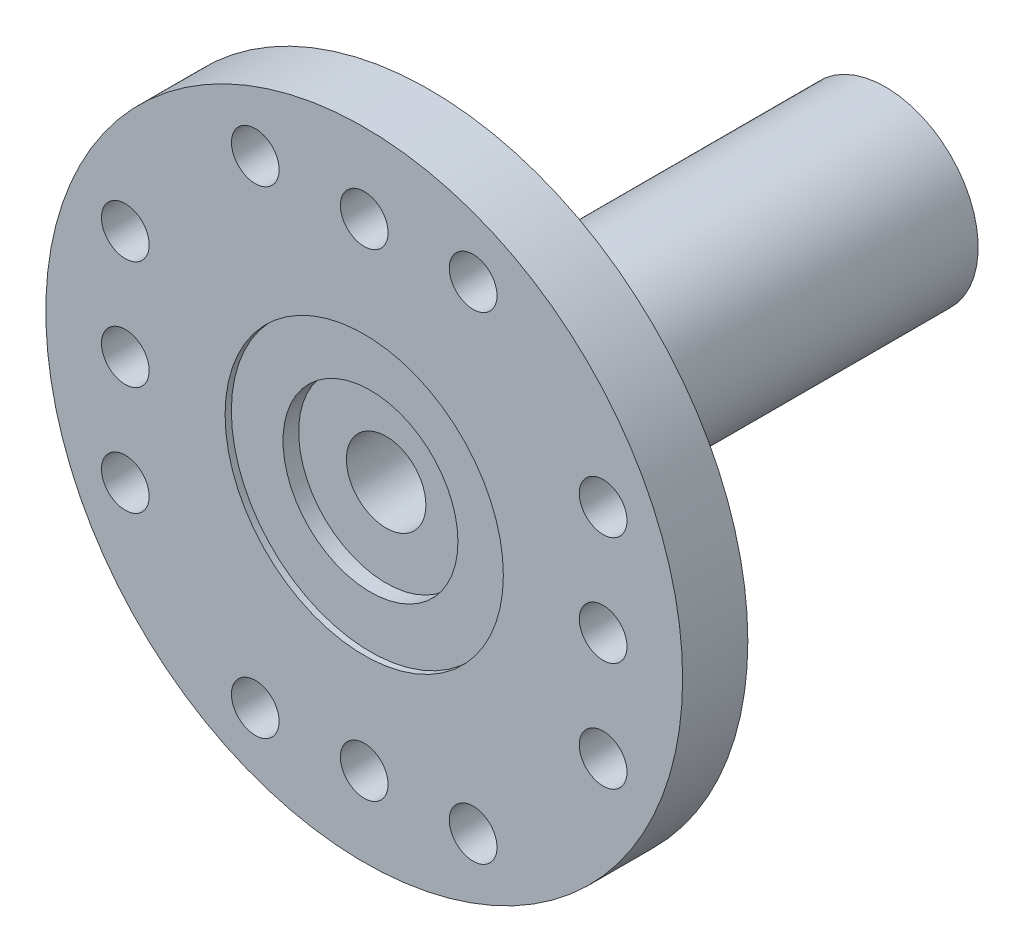
ISO-10303-21;
HEADER;
FILE_DESCRIPTION(('STEP AP214'),'2;1');
FILE_NAME('part.step','',(''),(''),'','','');
FILE_SCHEMA(('AUTOMOTIVE_DESIGN { 1 0 10303 214 1 1 1 1 }'));
ENDSEC;
DATA;
#1=APPLICATION_CONTEXT('core data for automotive mechanical design processes');
#2=APPLICATION_PROTOCOL_DEFINITION('international standard','automotive_design',2000,#1);
#3=PRODUCT_CONTEXT('',#1,'mechanical');
#4=PRODUCT('Part','Part','',(#3));
#5=PRODUCT_RELATED_PRODUCT_CATEGORY('part','',(#4));
#6=PRODUCT_DEFINITION_FORMATION('','',#4);
#7=PRODUCT_DEFINITION_CONTEXT('part definition',#1,'design');
#8=PRODUCT_DEFINITION('design','',#6,#7);
#9=PRODUCT_DEFINITION_SHAPE('','',#8);
#10=(LENGTH_UNIT() NAMED_UNIT(*) SI_UNIT(.MILLI.,.METRE.));
#11=(NAMED_UNIT(*) PLANE_ANGLE_UNIT() SI_UNIT($,.RADIAN.));
#12=(NAMED_UNIT(*) SI_UNIT($,.STERADIAN.) SOLID_ANGLE_UNIT());
#13=UNCERTAINTY_MEASURE_WITH_UNIT(LENGTH_MEASURE(1.E-05),#10,'distance_accuracy_value','');
#14=(GEOMETRIC_REPRESENTATION_CONTEXT(3) GLOBAL_UNCERTAINTY_ASSIGNED_CONTEXT((#13)) GLOBAL_UNIT_ASSIGNED_CONTEXT((#10,
#11,#12)) REPRESENTATION_CONTEXT('',''));
#15=CARTESIAN_POINT('',(0.,0.,0.));
#16=DIRECTION('',(0.,0.,1.));
#17=DIRECTION('',(1.,0.,0.));
#18=AXIS2_PLACEMENT_3D('',#15,#16,#17);
#19=CARTESIAN_POINT('',(0.,0.,-3.302));
#20=DIRECTION('',(0.,0.,-1.));
#21=DIRECTION('',(-1.,0.,0.));
#22=AXIS2_PLACEMENT_3D('',#19,#20,#21);
#23=PLANE('',#22);
#24=CARTESIAN_POINT('',(0.,0.,-3.302));
#25=DIRECTION('',(0.,0.,-1.));
#26=DIRECTION('',(-1.,0.,0.));
#27=AXIS2_PLACEMENT_3D('',#24,#25,#26);
#28=CIRCLE('',#27,4.699);
#29=CARTESIAN_POINT('',(-4.699,0.,-3.302));
#30=VERTEX_POINT('',#29);
#31=EDGE_CURVE('E46',#30,#30,#28,.T.);
#32=ORIENTED_EDGE('',*,*,#31,.T.);
#33=EDGE_LOOP('',(#32));
#34=FACE_BOUND('',#33,.T.);
#35=CARTESIAN_POINT('',(0.,0.,-3.302));
#36=DIRECTION('',(0.,0.,-1.));
#37=DIRECTION('',(-1.,0.,0.));
#38=AXIS2_PLACEMENT_3D('',#35,#36,#37);
#39=CIRCLE('',#38,2.9591);
#40=CARTESIAN_POINT('',(-2.9591,0.,-3.302));
#41=VERTEX_POINT('',#40);
#42=EDGE_CURVE('E51',#41,#41,#39,.T.);
#43=ORIENTED_EDGE('',*,*,#42,.F.);
#44=EDGE_LOOP('',(#43));
#45=FACE_BOUND('',#44,.T.);
#46=ADVANCED_FACE('F30',(#34,#45),#23,.T.);
#47=CARTESIAN_POINT('',(0.,0.,0.));
#48=DIRECTION('',(0.,0.,1.));
#49=DIRECTION('',(1.,0.,0.));
#50=AXIS2_PLACEMENT_3D('',#47,#48,#49);
#51=PLANE('',#50);
#52=CARTESIAN_POINT('',(3.47980000000008,-7.63269999999996,0.));
#53=DIRECTION('',(0.,0.,1.));
#54=DIRECTION('',(1.,0.,0.));
#55=AXIS2_PLACEMENT_3D('',#52,#53,#54);
#56=CIRCLE('',#55,0.762000000000002);
#57=CARTESIAN_POINT('',(4.24180000000008,-7.63269999999996,0.));
#58=VERTEX_POINT('',#57);
#59=EDGE_CURVE('E140',#58,#58,#56,.F.);
#60=ORIENTED_EDGE('',*,*,#59,.F.);
#61=EDGE_LOOP('',(#60));
#62=FACE_BOUND('',#61,.T.);
#63=CARTESIAN_POINT('',(-3.47979999999992,-7.63270000000004,0.));
#64=DIRECTION('',(0.,0.,1.));
#65=DIRECTION('',(1.,0.,0.));
#66=AXIS2_PLACEMENT_3D('',#63,#64,#65);
#67=CIRCLE('',#66,0.762000000000001);
#68=CARTESIAN_POINT('',(-2.71779999999992,-7.63270000000004,0.));
#69=VERTEX_POINT('',#68);
#70=EDGE_CURVE('E134',#69,#69,#67,.F.);
#71=ORIENTED_EDGE('',*,*,#70,.F.);
#72=EDGE_LOOP('',(#71));
#73=FACE_BOUND('',#72,.T.);
#74=CARTESIAN_POINT('',(0.,-7.6327,0.));
#75=DIRECTION('',(0.,0.,1.));
#76=DIRECTION('',(1.,0.,0.));
#77=AXIS2_PLACEMENT_3D('',#74,#75,#76);
#78=CIRCLE('',#77,0.762000000000001);
#79=CARTESIAN_POINT('',(0.762000000000081,-7.6327,0.));
#80=VERTEX_POINT('',#79);
#81=EDGE_CURVE('E128',#80,#80,#78,.F.);
#82=ORIENTED_EDGE('',*,*,#81,.F.);
#83=EDGE_LOOP('',(#82));
#84=FACE_BOUND('',#83,.T.);
#85=CARTESIAN_POINT('',(-7.63269999999998,-3.47980000000005,0.));
#86=DIRECTION('',(0.,0.,1.));
#87=DIRECTION('',(1.,0.,0.));
#88=AXIS2_PLACEMENT_3D('',#85,#86,#87);
#89=CIRCLE('',#88,0.762000000000002);
#90=CARTESIAN_POINT('',(-6.87069999999997,-3.47980000000005,0.));
#91=VERTEX_POINT('',#90);
#92=EDGE_CURVE('E122',#91,#91,#89,.F.);
#93=ORIENTED_EDGE('',*,*,#92,.F.);
#94=EDGE_LOOP('',(#93));
#95=FACE_BOUND('',#94,.T.);
#96=CARTESIAN_POINT('',(-7.63270000000002,3.47979999999995,0.));
#97=DIRECTION('',(0.,0.,1.));
#98=DIRECTION('',(1.,0.,0.));
#99=AXIS2_PLACEMENT_3D('',#96,#97,#98);
#100=CIRCLE('',#99,0.762000000000001);
#101=CARTESIAN_POINT('',(-6.87070000000002,3.47979999999995,0.));
#102=VERTEX_POINT('',#101);
#103=EDGE_CURVE('E116',#102,#102,#100,.F.);
#104=ORIENTED_EDGE('',*,*,#103,.F.);
#105=EDGE_LOOP('',(#104));
#106=FACE_BOUND('',#105,.T.);
#107=CARTESIAN_POINT('',(-7.6327,0.,0.));
#108=DIRECTION('',(0.,0.,1.));
#109=DIRECTION('',(1.,0.,0.));
#110=AXIS2_PLACEMENT_3D('',#107,#108,#109);
#111=CIRCLE('',#110,0.762000000000001);
#112=CARTESIAN_POINT('',(-6.8707,0.,0.));
#113=VERTEX_POINT('',#112);
#114=EDGE_CURVE('E110',#113,#113,#111,.F.);
#115=ORIENTED_EDGE('',*,*,#114,.F.);
#116=EDGE_LOOP('',(#115));
#117=FACE_BOUND('',#116,.T.);
#118=CARTESIAN_POINT('',(-3.47980000000003,7.63269999999999,0.));
#119=DIRECTION('',(0.,0.,1.));
#120=DIRECTION('',(1.,0.,0.));
#121=AXIS2_PLACEMENT_3D('',#118,#119,#120);
#122=CIRCLE('',#121,0.762000000000002);
#123=CARTESIAN_POINT('',(-2.71780000000002,7.63269999999999,0.));
#124=VERTEX_POINT('',#123);
#125=EDGE_CURVE('E104',#124,#124,#122,.F.);
#126=ORIENTED_EDGE('',*,*,#125,.F.);
#127=EDGE_LOOP('',(#126));
#128=FACE_BOUND('',#127,.T.);
#129=CARTESIAN_POINT('',(3.47979999999997,7.63270000000001,0.));
#130=DIRECTION('',(0.,0.,1.));
#131=DIRECTION('',(1.,0.,0.));
#132=AXIS2_PLACEMENT_3D('',#129,#130,#131);
#133=CIRCLE('',#132,0.762000000000001);
#134=CARTESIAN_POINT('',(4.24179999999997,7.63270000000001,0.));
#135=VERTEX_POINT('',#134);
#136=EDGE_CURVE('E98',#135,#135,#133,.F.);
#137=ORIENTED_EDGE('',*,*,#136,.F.);
#138=EDGE_LOOP('',(#137));
#139=FACE_BOUND('',#138,.T.);
#140=CARTESIAN_POINT('',(0.,7.6327,0.));
#141=DIRECTION('',(0.,0.,1.));
#142=DIRECTION('',(1.,0.,0.));
#143=AXIS2_PLACEMENT_3D('',#140,#141,#142);
#144=CIRCLE('',#143,0.762000000000001);
#145=CARTESIAN_POINT('',(0.761999999999974,7.6327,0.));
#146=VERTEX_POINT('',#145);
#147=EDGE_CURVE('E92',#146,#146,#144,.F.);
#148=ORIENTED_EDGE('',*,*,#147,.F.);
#149=EDGE_LOOP('',(#148));
#150=FACE_BOUND('',#149,.T.);
#151=CARTESIAN_POINT('',(7.6327,3.4798,0.));
#152=DIRECTION('',(0.,0.,1.));
#153=DIRECTION('',(1.,0.,0.));
#154=AXIS2_PLACEMENT_3D('',#151,#152,#153);
#155=CIRCLE('',#154,0.762000000000002);
#156=CARTESIAN_POINT('',(8.3947,3.4798,0.));
#157=VERTEX_POINT('',#156);
#158=EDGE_CURVE('E86',#157,#157,#155,.F.);
#159=ORIENTED_EDGE('',*,*,#158,.F.);
#160=EDGE_LOOP('',(#159));
#161=FACE_BOUND('',#160,.T.);
#162=CARTESIAN_POINT('',(7.6327,-3.4798,0.));
#163=DIRECTION('',(0.,0.,1.));
#164=DIRECTION('',(1.,0.,0.));
#165=AXIS2_PLACEMENT_3D('',#162,#163,#164);
#166=CIRCLE('',#165,0.762000000000001);
#167=CARTESIAN_POINT('',(8.3947,-3.4798,0.));
#168=VERTEX_POINT('',#167);
#169=EDGE_CURVE('E80',#168,#168,#166,.F.);
#170=ORIENTED_EDGE('',*,*,#169,.F.);
#171=EDGE_LOOP('',(#170));
#172=FACE_BOUND('',#171,.T.);
#173=CARTESIAN_POINT('',(7.6327,0.,0.));
#174=DIRECTION('',(0.,0.,1.));
#175=DIRECTION('',(1.,0.,0.));
#176=AXIS2_PLACEMENT_3D('',#173,#174,#175);
#177=CIRCLE('',#176,0.762000000000001);
#178=CARTESIAN_POINT('',(8.3947,0.,0.));
#179=VERTEX_POINT('',#178);
#180=EDGE_CURVE('E72',#179,#179,#177,.F.);
#181=ORIENTED_EDGE('',*,*,#180,.F.);
#182=EDGE_LOOP('',(#181));
#183=FACE_BOUND('',#182,.T.);
#184=CARTESIAN_POINT('',(0.,0.,0.));
#185=DIRECTION('',(0.,0.,1.));
#186=DIRECTION('',(1.,0.,0.));
#187=AXIS2_PLACEMENT_3D('',#184,#185,#186);
#188=CIRCLE('',#187,10.1727);
#189=CARTESIAN_POINT('',(10.1727,0.,0.));
#190=VERTEX_POINT('',#189);
#191=EDGE_CURVE('E41',#190,#190,#188,.T.);
#192=ORIENTED_EDGE('',*,*,#191,.F.);
#193=EDGE_LOOP('',(#192));
#194=FACE_BOUND('',#193,.T.);
#195=CARTESIAN_POINT('',(0.,0.,0.));
#196=DIRECTION('',(0.,0.,1.));
#197=DIRECTION('',(1.,0.,0.));
#198=AXIS2_PLACEMENT_3D('',#195,#196,#197);
#199=CIRCLE('',#198,4.699);
#200=CARTESIAN_POINT('',(4.699,0.,0.));
#201=VERTEX_POINT('',#200);
#202=EDGE_CURVE('E10',#201,#201,#199,.F.);
#203=ORIENTED_EDGE('',*,*,#202,.F.);
#204=EDGE_LOOP('',(#203));
#205=FACE_BOUND('',#204,.T.);
#206=ADVANCED_FACE('F197',(#62,#73,#84,#95,#106,#117,#128,#139,#150,#161,#172,#183,#194,#205),
#51,.F.);
#207=CARTESIAN_POINT('',(0.,0.,2.0828));
#208=DIRECTION('',(0.,0.,-1.));
#209=DIRECTION('',(-1.,0.,0.));
#210=AXIS2_PLACEMENT_3D('',#207,#208,#209);
#211=CYLINDRICAL_SURFACE('',#210,10.1727);
#212=CARTESIAN_POINT('',(0.,0.,2.0828));
#213=DIRECTION('',(0.,0.,1.));
#214=DIRECTION('',(1.,0.,0.));
#215=AXIS2_PLACEMENT_3D('',#212,#213,#214);
#216=CIRCLE('',#215,10.1727);
#217=CARTESIAN_POINT('',(10.1727,0.,2.0828));
#218=VERTEX_POINT('',#217);
#219=EDGE_CURVE('E37',#218,#218,#216,.T.);
#220=ORIENTED_EDGE('',*,*,#219,.F.);
#221=EDGE_LOOP('',(#220));
#222=FACE_BOUND('',#221,.T.);
#223=ORIENTED_EDGE('',*,*,#191,.T.);
#224=EDGE_LOOP('',(#223));
#225=FACE_BOUND('',#224,.T.);
#226=ADVANCED_FACE('F32',(#222,#225),#211,.T.);
#227=CARTESIAN_POINT('',(0.,0.,2.0828));
#228=DIRECTION('',(0.,0.,1.));
#229=DIRECTION('',(1.,0.,0.));
#230=AXIS2_PLACEMENT_3D('',#227,#228,#229);
#231=PLANE('',#230);
#232=CARTESIAN_POINT('',(3.47980000000008,-7.63269999999996,2.0828));
#233=DIRECTION('',(0.,0.,1.));
#234=DIRECTION('',(0.,-1.,0.));
#235=AXIS2_PLACEMENT_3D('',#232,#233,#234);
#236=CIRCLE('',#235,0.762000000000002);
#237=CARTESIAN_POINT('',(3.47980000000009,-8.39469999999996,2.0828));
#238=VERTEX_POINT('',#237);
#239=EDGE_CURVE('E143',#238,#238,#236,.T.);
#240=ORIENTED_EDGE('',*,*,#239,.F.);
#241=EDGE_LOOP('',(#240));
#242=FACE_BOUND('',#241,.T.);
#243=CARTESIAN_POINT('',(-3.47979999999992,-7.63270000000004,2.0828));
#244=DIRECTION('',(0.,0.,1.));
#245=DIRECTION('',(0.,-1.,0.));
#246=AXIS2_PLACEMENT_3D('',#243,#244,#245);
#247=CIRCLE('',#246,0.762000000000001);
#248=CARTESIAN_POINT('',(-3.47979999999991,-8.39470000000004,2.0828));
#249=VERTEX_POINT('',#248);
#250=EDGE_CURVE('E137',#249,#249,#247,.T.);
#251=ORIENTED_EDGE('',*,*,#250,.F.);
#252=EDGE_LOOP('',(#251));
#253=FACE_BOUND('',#252,.T.);
#254=CARTESIAN_POINT('',(0.,-7.6327,2.0828));
#255=DIRECTION('',(0.,0.,1.));
#256=DIRECTION('',(0.,-1.,0.));
#257=AXIS2_PLACEMENT_3D('',#254,#255,#256);
#258=CIRCLE('',#257,0.762000000000001);
#259=CARTESIAN_POINT('',(0.,-8.3947,2.0828));
#260=VERTEX_POINT('',#259);
#261=EDGE_CURVE('E131',#260,#260,#258,.T.);
#262=ORIENTED_EDGE('',*,*,#261,.F.);
#263=EDGE_LOOP('',(#262));
#264=FACE_BOUND('',#263,.T.);
#265=CARTESIAN_POINT('',(-7.63269999999998,-3.47980000000005,2.0828));
#266=DIRECTION('',(0.,0.,1.));
#267=DIRECTION('',(-1.,0.,0.));
#268=AXIS2_PLACEMENT_3D('',#265,#266,#267);
#269=CIRCLE('',#268,0.762000000000002);
#270=CARTESIAN_POINT('',(-8.39469999999998,-3.47980000000006,2.0828));
#271=VERTEX_POINT('',#270);
#272=EDGE_CURVE('E125',#271,#271,#269,.T.);
#273=ORIENTED_EDGE('',*,*,#272,.F.);
#274=EDGE_LOOP('',(#273));
#275=FACE_BOUND('',#274,.T.);
#276=CARTESIAN_POINT('',(-7.63270000000002,3.47979999999995,2.0828));
#277=DIRECTION('',(0.,0.,1.));
#278=DIRECTION('',(-1.,0.,0.));
#279=AXIS2_PLACEMENT_3D('',#276,#277,#278);
#280=CIRCLE('',#279,0.762000000000001);
#281=CARTESIAN_POINT('',(-8.39470000000002,3.47979999999994,2.0828));
#282=VERTEX_POINT('',#281);
#283=EDGE_CURVE('E119',#282,#282,#280,.T.);
#284=ORIENTED_EDGE('',*,*,#283,.F.);
#285=EDGE_LOOP('',(#284));
#286=FACE_BOUND('',#285,.T.);
#287=CARTESIAN_POINT('',(-7.6327,0.,2.0828));
#288=DIRECTION('',(0.,0.,1.));
#289=DIRECTION('',(-1.,0.,0.));
#290=AXIS2_PLACEMENT_3D('',#287,#288,#289);
#291=CIRCLE('',#290,0.762000000000001);
#292=CARTESIAN_POINT('',(-8.3947,0.,2.0828));
#293=VERTEX_POINT('',#292);
#294=EDGE_CURVE('E113',#293,#293,#291,.T.);
#295=ORIENTED_EDGE('',*,*,#294,.F.);
#296=EDGE_LOOP('',(#295));
#297=FACE_BOUND('',#296,.T.);
#298=CARTESIAN_POINT('',(-3.47980000000003,7.63269999999999,2.0828));
#299=DIRECTION('',(0.,0.,1.));
#300=DIRECTION('',(0.,1.,0.));
#301=AXIS2_PLACEMENT_3D('',#298,#299,#300);
#302=CIRCLE('',#301,0.762000000000002);
#303=CARTESIAN_POINT('',(-3.47980000000003,8.39469999999999,2.0828));
#304=VERTEX_POINT('',#303);
#305=EDGE_CURVE('E107',#304,#304,#302,.T.);
#306=ORIENTED_EDGE('',*,*,#305,.F.);
#307=EDGE_LOOP('',(#306));
#308=FACE_BOUND('',#307,.T.);
#309=CARTESIAN_POINT('',(3.47979999999997,7.63270000000001,2.0828));
#310=DIRECTION('',(0.,0.,1.));
#311=DIRECTION('',(0.,1.,0.));
#312=AXIS2_PLACEMENT_3D('',#309,#310,#311);
#313=CIRCLE('',#312,0.762000000000001);
#314=CARTESIAN_POINT('',(3.47979999999997,8.39470000000001,2.0828));
#315=VERTEX_POINT('',#314);
#316=EDGE_CURVE('E101',#315,#315,#313,.T.);
#317=ORIENTED_EDGE('',*,*,#316,.F.);
#318=EDGE_LOOP('',(#317));
#319=FACE_BOUND('',#318,.T.);
#320=CARTESIAN_POINT('',(0.,7.6327,2.0828));
#321=DIRECTION('',(0.,0.,1.));
#322=DIRECTION('',(0.,1.,0.));
#323=AXIS2_PLACEMENT_3D('',#320,#321,#322);
#324=CIRCLE('',#323,0.762000000000001);
#325=CARTESIAN_POINT('',(0.,8.3947,2.0828));
#326=VERTEX_POINT('',#325);
#327=EDGE_CURVE('E95',#326,#326,#324,.T.);
#328=ORIENTED_EDGE('',*,*,#327,.F.);
#329=EDGE_LOOP('',(#328));
#330=FACE_BOUND('',#329,.T.);
#331=CARTESIAN_POINT('',(7.6327,3.4798,2.0828));
#332=DIRECTION('',(0.,0.,1.));
#333=DIRECTION('',(1.,0.,0.));
#334=AXIS2_PLACEMENT_3D('',#331,#332,#333);
#335=CIRCLE('',#334,0.762000000000002);
#336=CARTESIAN_POINT('',(8.3947,3.4798,2.0828));
#337=VERTEX_POINT('',#336);
#338=EDGE_CURVE('E89',#337,#337,#335,.T.);
#339=ORIENTED_EDGE('',*,*,#338,.F.);
#340=EDGE_LOOP('',(#339));
#341=FACE_BOUND('',#340,.T.);
#342=CARTESIAN_POINT('',(7.6327,-3.4798,2.0828));
#343=DIRECTION('',(0.,0.,1.));
#344=DIRECTION('',(1.,0.,0.));
#345=AXIS2_PLACEMENT_3D('',#342,#343,#344);
#346=CIRCLE('',#345,0.762000000000001);
#347=CARTESIAN_POINT('',(8.3947,-3.4798,2.0828));
#348=VERTEX_POINT('',#347);
#349=EDGE_CURVE('E83',#348,#348,#346,.T.);
#350=ORIENTED_EDGE('',*,*,#349,.F.);
#351=EDGE_LOOP('',(#350));
#352=FACE_BOUND('',#351,.T.);
#353=CARTESIAN_POINT('',(7.6327,0.,2.0828));
#354=DIRECTION('',(0.,0.,1.));
#355=DIRECTION('',(1.,0.,0.));
#356=AXIS2_PLACEMENT_3D('',#353,#354,#355);
#357=CIRCLE('',#356,0.762000000000001);
#358=CARTESIAN_POINT('',(8.3947,0.,2.0828));
#359=VERTEX_POINT('',#358);
#360=EDGE_CURVE('E77',#359,#359,#357,.T.);
#361=ORIENTED_EDGE('',*,*,#360,.F.);
#362=EDGE_LOOP('',(#361));
#363=FACE_BOUND('',#362,.T.);
#364=CARTESIAN_POINT('',(0.,0.,2.0828));
#365=DIRECTION('',(0.,0.,1.));
#366=DIRECTION('',(1.,0.,0.));
#367=AXIS2_PLACEMENT_3D('',#364,#365,#366);
#368=CIRCLE('',#367,4.445);
#369=CARTESIAN_POINT('',(4.445,0.,2.0828));
#370=VERTEX_POINT('',#369);
#371=EDGE_CURVE('E57',#370,#370,#368,.T.);
#372=ORIENTED_EDGE('',*,*,#371,.F.);
#373=EDGE_LOOP('',(#372));
#374=FACE_BOUND('',#373,.T.);
#375=ORIENTED_EDGE('',*,*,#219,.T.);
#376=EDGE_LOOP('',(#375));
#377=FACE_BOUND('',#376,.T.);
#378=ADVANCED_FACE('F150',(#242,#253,#264,#275,#286,#297,#308,#319,#330,#341,#352,#363,#374,
#377),#231,.T.);
#379=CARTESIAN_POINT('',(0.,0.,-3.302));
#380=DIRECTION('',(0.,0.,1.));
#381=DIRECTION('',(1.,0.,0.));
#382=AXIS2_PLACEMENT_3D('',#379,#380,#381);
#383=CYLINDRICAL_SURFACE('',#382,4.699);
#384=ORIENTED_EDGE('',*,*,#31,.F.);
#385=EDGE_LOOP('',(#384));
#386=FACE_BOUND('',#385,.T.);
#387=ORIENTED_EDGE('',*,*,#202,.T.);
#388=EDGE_LOOP('',(#387));
#389=FACE_BOUND('',#388,.T.);
#390=ADVANCED_FACE('F153',(#386,#389),#383,.T.);
#391=CARTESIAN_POINT('',(0.,0.,-14.572));
#392=DIRECTION('',(0.,0.,1.));
#393=DIRECTION('',(1.,0.,0.));
#394=AXIS2_PLACEMENT_3D('',#391,#392,#393);
#395=CYLINDRICAL_SURFACE('',#394,2.9591);
#396=CARTESIAN_POINT('',(0.,0.,-14.572));
#397=DIRECTION('',(0.,0.,-1.));
#398=DIRECTION('',(-1.,0.,0.));
#399=AXIS2_PLACEMENT_3D('',#396,#397,#398);
#400=CIRCLE('',#399,2.9591);
#401=CARTESIAN_POINT('',(-2.9591,0.,-14.572));
#402=VERTEX_POINT('',#401);
#403=EDGE_CURVE('E50',#402,#402,#400,.T.);
#404=ORIENTED_EDGE('',*,*,#403,.F.);
#405=EDGE_LOOP('',(#404));
#406=FACE_BOUND('',#405,.T.);
#407=ORIENTED_EDGE('',*,*,#42,.T.);
#408=EDGE_LOOP('',(#407));
#409=FACE_BOUND('',#408,.T.);
#410=ADVANCED_FACE('F192',(#406,#409),#395,.T.);
#411=CARTESIAN_POINT('',(0.,0.,-14.572));
#412=DIRECTION('',(0.,0.,-1.));
#413=DIRECTION('',(-1.,0.,0.));
#414=AXIS2_PLACEMENT_3D('',#411,#412,#413);
#415=PLANE('',#414);
#416=CARTESIAN_POINT('',(0.,0.,-14.572));
#417=DIRECTION('',(0.,0.,1.));
#418=DIRECTION('',(1.,0.,0.));
#419=AXIS2_PLACEMENT_3D('',#416,#417,#418);
#420=CIRCLE('',#419,1.27);
#421=CARTESIAN_POINT('',(1.27,0.,-14.572));
#422=VERTEX_POINT('',#421);
#423=EDGE_CURVE('E66',#422,#422,#420,.T.);
#424=ORIENTED_EDGE('',*,*,#423,.T.);
#425=EDGE_LOOP('',(#424));
#426=FACE_BOUND('',#425,.T.);
#427=ORIENTED_EDGE('',*,*,#403,.T.);
#428=EDGE_LOOP('',(#427));
#429=FACE_BOUND('',#428,.T.);
#430=ADVANCED_FACE('F182',(#426,#429),#415,.T.);
#431=CARTESIAN_POINT('',(0.,0.,1.8828));
#432=DIRECTION('',(0.,0.,1.));
#433=DIRECTION('',(1.,0.,0.));
#434=AXIS2_PLACEMENT_3D('',#431,#432,#433);
#435=CYLINDRICAL_SURFACE('',#434,4.445);
#436=CARTESIAN_POINT('',(0.,0.,1.8828));
#437=DIRECTION('',(0.,0.,1.));
#438=DIRECTION('',(1.,0.,0.));
#439=AXIS2_PLACEMENT_3D('',#436,#437,#438);
#440=CIRCLE('',#439,4.445);
#441=CARTESIAN_POINT('',(4.445,0.,1.8828));
#442=VERTEX_POINT('',#441);
#443=EDGE_CURVE('E54',#442,#442,#440,.T.);
#444=ORIENTED_EDGE('',*,*,#443,.F.);
#445=EDGE_LOOP('',(#444));
#446=FACE_BOUND('',#445,.T.);
#447=ORIENTED_EDGE('',*,*,#371,.T.);
#448=EDGE_LOOP('',(#447));
#449=FACE_BOUND('',#448,.T.);
#450=ADVANCED_FACE('F179',(#446,#449),#435,.F.);
#451=CARTESIAN_POINT('',(0.,0.,1.8828));
#452=DIRECTION('',(0.,0.,1.));
#453=DIRECTION('',(1.,0.,0.));
#454=AXIS2_PLACEMENT_3D('',#451,#452,#453);
#455=PLANE('',#454);
#456=CARTESIAN_POINT('',(0.,0.,1.8828));
#457=DIRECTION('',(0.,0.,1.));
#458=DIRECTION('',(1.,0.,0.));
#459=AXIS2_PLACEMENT_3D('',#456,#457,#458);
#460=CIRCLE('',#459,2.794);
#461=CARTESIAN_POINT('',(2.794,0.,1.8828));
#462=VERTEX_POINT('',#461);
#463=EDGE_CURVE('E63',#462,#462,#460,.T.);
#464=ORIENTED_EDGE('',*,*,#463,.F.);
#465=EDGE_LOOP('',(#464));
#466=FACE_BOUND('',#465,.T.);
#467=ORIENTED_EDGE('',*,*,#443,.T.);
#468=EDGE_LOOP('',(#467));
#469=FACE_BOUND('',#468,.T.);
#470=ADVANCED_FACE('F181',(#466,#469),#455,.T.);
#471=CARTESIAN_POINT('',(0.,0.,1.3828));
#472=DIRECTION('',(0.,0.,1.));
#473=DIRECTION('',(1.,0.,0.));
#474=AXIS2_PLACEMENT_3D('',#471,#472,#473);
#475=CYLINDRICAL_SURFACE('',#474,2.794);
#476=CARTESIAN_POINT('',(0.,0.,1.3828));
#477=DIRECTION('',(0.,0.,1.));
#478=DIRECTION('',(1.,0.,0.));
#479=AXIS2_PLACEMENT_3D('',#476,#477,#478);
#480=CIRCLE('',#479,2.794);
#481=CARTESIAN_POINT('',(2.794,0.,1.3828));
#482=VERTEX_POINT('',#481);
#483=EDGE_CURVE('E60',#482,#482,#480,.T.);
#484=ORIENTED_EDGE('',*,*,#483,.F.);
#485=EDGE_LOOP('',(#484));
#486=FACE_BOUND('',#485,.T.);
#487=ORIENTED_EDGE('',*,*,#463,.T.);
#488=EDGE_LOOP('',(#487));
#489=FACE_BOUND('',#488,.T.);
#490=ADVANCED_FACE('F189',(#486,#489),#475,.F.);
#491=CARTESIAN_POINT('',(0.,0.,1.3828));
#492=DIRECTION('',(0.,0.,1.));
#493=DIRECTION('',(1.,0.,0.));
#494=AXIS2_PLACEMENT_3D('',#491,#492,#493);
#495=PLANE('',#494);
#496=CARTESIAN_POINT('',(0.,0.,1.3828));
#497=DIRECTION('',(0.,0.,1.));
#498=DIRECTION('',(1.,0.,0.));
#499=AXIS2_PLACEMENT_3D('',#496,#497,#498);
#500=CIRCLE('',#499,1.27);
#501=CARTESIAN_POINT('',(1.27,0.,1.3828));
#502=VERTEX_POINT('',#501);
#503=EDGE_CURVE('E69',#502,#502,#500,.T.);
#504=ORIENTED_EDGE('',*,*,#503,.F.);
#505=EDGE_LOOP('',(#504));
#506=FACE_BOUND('',#505,.T.);
#507=ORIENTED_EDGE('',*,*,#483,.T.);
#508=EDGE_LOOP('',(#507));
#509=FACE_BOUND('',#508,.T.);
#510=ADVANCED_FACE('F235',(#506,#509),#495,.T.);
#511=CARTESIAN_POINT('',(0.,0.,-14.572));
#512=DIRECTION('',(0.,0.,1.));
#513=DIRECTION('',(1.,0.,0.));
#514=AXIS2_PLACEMENT_3D('',#511,#512,#513);
#515=CYLINDRICAL_SURFACE('',#514,1.27);
#516=ORIENTED_EDGE('',*,*,#423,.F.);
#517=EDGE_LOOP('',(#516));
#518=FACE_BOUND('',#517,.T.);
#519=ORIENTED_EDGE('',*,*,#503,.T.);
#520=EDGE_LOOP('',(#519));
#521=FACE_BOUND('',#520,.T.);
#522=ADVANCED_FACE('F240',(#518,#521),#515,.F.);
#523=CARTESIAN_POINT('',(7.6327,0.,-14.573));
#524=DIRECTION('',(0.,0.,1.));
#525=DIRECTION('',(1.,0.,0.));
#526=AXIS2_PLACEMENT_3D('',#523,#524,#525);
#527=CYLINDRICAL_SURFACE('',#526,0.762000000000001);
#528=ORIENTED_EDGE('',*,*,#360,.T.);
#529=EDGE_LOOP('',(#528));
#530=FACE_BOUND('',#529,.T.);
#531=ORIENTED_EDGE('',*,*,#180,.T.);
#532=EDGE_LOOP('',(#531));
#533=FACE_BOUND('',#532,.T.);
#534=ADVANCED_FACE('F250',(#530,#533),#527,.F.);
#535=CARTESIAN_POINT('',(7.6327,-3.4798,-14.573));
#536=DIRECTION('',(0.,0.,1.));
#537=DIRECTION('',(1.,0.,0.));
#538=AXIS2_PLACEMENT_3D('',#535,#536,#537);
#539=CYLINDRICAL_SURFACE('',#538,0.762000000000001);
#540=ORIENTED_EDGE('',*,*,#349,.T.);
#541=EDGE_LOOP('',(#540));
#542=FACE_BOUND('',#541,.T.);
#543=ORIENTED_EDGE('',*,*,#169,.T.);
#544=EDGE_LOOP('',(#543));
#545=FACE_BOUND('',#544,.T.);
#546=ADVANCED_FACE('F260',(#542,#545),#539,.F.);
#547=CARTESIAN_POINT('',(7.6327,3.4798,-14.573));
#548=DIRECTION('',(0.,0.,1.));
#549=DIRECTION('',(1.,0.,0.));
#550=AXIS2_PLACEMENT_3D('',#547,#548,#549);
#551=CYLINDRICAL_SURFACE('',#550,0.762000000000002);
#552=ORIENTED_EDGE('',*,*,#338,.T.);
#553=EDGE_LOOP('',(#552));
#554=FACE_BOUND('',#553,.T.);
#555=ORIENTED_EDGE('',*,*,#158,.T.);
#556=EDGE_LOOP('',(#555));
#557=FACE_BOUND('',#556,.T.);
#558=ADVANCED_FACE('F270',(#554,#557),#551,.F.);
#559=CARTESIAN_POINT('',(0.,7.6327,-14.573));
#560=DIRECTION('',(0.,0.,1.));
#561=DIRECTION('',(1.,0.,0.));
#562=AXIS2_PLACEMENT_3D('',#559,#560,#561);
#563=CYLINDRICAL_SURFACE('',#562,0.762000000000001);
#564=ORIENTED_EDGE('',*,*,#327,.T.);
#565=EDGE_LOOP('',(#564));
#566=FACE_BOUND('',#565,.T.);
#567=ORIENTED_EDGE('',*,*,#147,.T.);
#568=EDGE_LOOP('',(#567));
#569=FACE_BOUND('',#568,.T.);
#570=ADVANCED_FACE('F280',(#566,#569),#563,.F.);
#571=CARTESIAN_POINT('',(3.47979999999997,7.63270000000001,-14.573));
#572=DIRECTION('',(0.,0.,1.));
#573=DIRECTION('',(1.,0.,0.));
#574=AXIS2_PLACEMENT_3D('',#571,#572,#573);
#575=CYLINDRICAL_SURFACE('',#574,0.762000000000001);
#576=ORIENTED_EDGE('',*,*,#316,.T.);
#577=EDGE_LOOP('',(#576));
#578=FACE_BOUND('',#577,.T.);
#579=ORIENTED_EDGE('',*,*,#136,.T.);
#580=EDGE_LOOP('',(#579));
#581=FACE_BOUND('',#580,.T.);
#582=ADVANCED_FACE('F305',(#578,#581),#575,.F.);
#583=CARTESIAN_POINT('',(-3.47980000000003,7.63269999999999,-14.573));
#584=DIRECTION('',(0.,0.,1.));
#585=DIRECTION('',(1.,0.,0.));
#586=AXIS2_PLACEMENT_3D('',#583,#584,#585);
#587=CYLINDRICAL_SURFACE('',#586,0.762000000000002);
#588=ORIENTED_EDGE('',*,*,#305,.T.);
#589=EDGE_LOOP('',(#588));
#590=FACE_BOUND('',#589,.T.);
#591=ORIENTED_EDGE('',*,*,#125,.T.);
#592=EDGE_LOOP('',(#591));
#593=FACE_BOUND('',#592,.T.);
#594=ADVANCED_FACE('F315',(#590,#593),#587,.F.);
#595=CARTESIAN_POINT('',(-7.6327,0.,-14.573));
#596=DIRECTION('',(0.,0.,1.));
#597=DIRECTION('',(1.,0.,0.));
#598=AXIS2_PLACEMENT_3D('',#595,#596,#597);
#599=CYLINDRICAL_SURFACE('',#598,0.762000000000001);
#600=ORIENTED_EDGE('',*,*,#294,.T.);
#601=EDGE_LOOP('',(#600));
#602=FACE_BOUND('',#601,.T.);
#603=ORIENTED_EDGE('',*,*,#114,.T.);
#604=EDGE_LOOP('',(#603));
#605=FACE_BOUND('',#604,.T.);
#606=ADVANCED_FACE('F325',(#602,#605),#599,.F.);
#607=CARTESIAN_POINT('',(-7.63270000000002,3.47979999999995,-14.573));
#608=DIRECTION('',(0.,0.,1.));
#609=DIRECTION('',(1.,0.,0.));
#610=AXIS2_PLACEMENT_3D('',#607,#608,#609);
#611=CYLINDRICAL_SURFACE('',#610,0.762000000000001);
#612=ORIENTED_EDGE('',*,*,#283,.T.);
#613=EDGE_LOOP('',(#612));
#614=FACE_BOUND('',#613,.T.);
#615=ORIENTED_EDGE('',*,*,#103,.T.);
#616=EDGE_LOOP('',(#615));
#617=FACE_BOUND('',#616,.T.);
#618=ADVANCED_FACE('F335',(#614,#617),#611,.F.);
#619=CARTESIAN_POINT('',(-7.63269999999998,-3.47980000000005,-14.573));
#620=DIRECTION('',(0.,0.,1.));
#621=DIRECTION('',(1.,0.,0.));
#622=AXIS2_PLACEMENT_3D('',#619,#620,#621);
#623=CYLINDRICAL_SURFACE('',#622,0.762000000000002);
#624=ORIENTED_EDGE('',*,*,#272,.T.);
#625=EDGE_LOOP('',(#624));
#626=FACE_BOUND('',#625,.T.);
#627=ORIENTED_EDGE('',*,*,#92,.T.);
#628=EDGE_LOOP('',(#627));
#629=FACE_BOUND('',#628,.T.);
#630=ADVANCED_FACE('F345',(#626,#629),#623,.F.);
#631=CARTESIAN_POINT('',(0.,-7.6327,-14.573));
#632=DIRECTION('',(0.,0.,1.));
#633=DIRECTION('',(1.,0.,0.));
#634=AXIS2_PLACEMENT_3D('',#631,#632,#633);
#635=CYLINDRICAL_SURFACE('',#634,0.762000000000001);
#636=ORIENTED_EDGE('',*,*,#261,.T.);
#637=EDGE_LOOP('',(#636));
#638=FACE_BOUND('',#637,.T.);
#639=ORIENTED_EDGE('',*,*,#81,.T.);
#640=EDGE_LOOP('',(#639));
#641=FACE_BOUND('',#640,.T.);
#642=ADVANCED_FACE('F355',(#638,#641),#635,.F.);
#643=CARTESIAN_POINT('',(-3.47979999999992,-7.63270000000004,-14.573));
#644=DIRECTION('',(0.,0.,1.));
#645=DIRECTION('',(1.,0.,0.));
#646=AXIS2_PLACEMENT_3D('',#643,#644,#645);
#647=CYLINDRICAL_SURFACE('',#646,0.762000000000001);
#648=ORIENTED_EDGE('',*,*,#250,.T.);
#649=EDGE_LOOP('',(#648));
#650=FACE_BOUND('',#649,.T.);
#651=ORIENTED_EDGE('',*,*,#70,.T.);
#652=EDGE_LOOP('',(#651));
#653=FACE_BOUND('',#652,.T.);
#654=ADVANCED_FACE('F365',(#650,#653),#647,.F.);
#655=CARTESIAN_POINT('',(3.47980000000008,-7.63269999999996,-14.573));
#656=DIRECTION('',(0.,0.,1.));
#657=DIRECTION('',(1.,0.,0.));
#658=AXIS2_PLACEMENT_3D('',#655,#656,#657);
#659=CYLINDRICAL_SURFACE('',#658,0.762000000000002);
#660=ORIENTED_EDGE('',*,*,#239,.T.);
#661=EDGE_LOOP('',(#660));
#662=FACE_BOUND('',#661,.T.);
#663=ORIENTED_EDGE('',*,*,#59,.T.);
#664=EDGE_LOOP('',(#663));
#665=FACE_BOUND('',#664,.T.);
#666=ADVANCED_FACE('F147',(#662,#665),#659,.F.);
#667=CLOSED_SHELL('',(#46,#206,#226,#378,#390,#410,#430,#450,#470,#490,#510,#522,#534,#546,#558,
#570,#582,#594,#606,#618,#630,#642,#654,#666));
#668=MANIFOLD_SOLID_BREP('B2',#667);
#669=ADVANCED_BREP_SHAPE_REPRESENTATION('',(#18,#668),#14);
#670=SHAPE_DEFINITION_REPRESENTATION(#9,#669);
ENDSEC;
END-ISO-10303-21;
